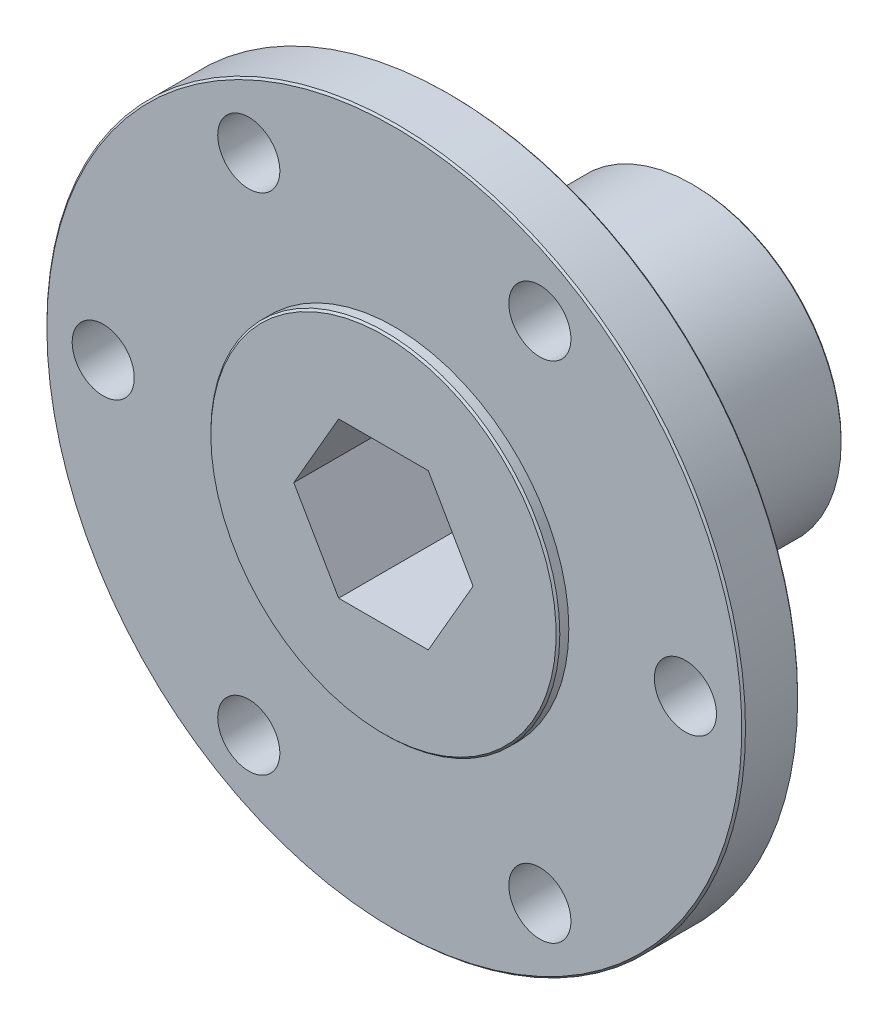
ISO-10303-21;
HEADER;
FILE_DESCRIPTION(('STEP AP214'),'2;1');
FILE_NAME('part.step','',(''),(''),'','','');
FILE_SCHEMA(('AUTOMOTIVE_DESIGN { 1 0 10303 214 1 1 1 1 }'));
ENDSEC;
DATA;
#1=APPLICATION_CONTEXT('core data for automotive mechanical design processes');
#2=APPLICATION_PROTOCOL_DEFINITION('international standard','automotive_design',2000,#1);
#3=PRODUCT_CONTEXT('',#1,'mechanical');
#4=PRODUCT('Part','Part','',(#3));
#5=PRODUCT_RELATED_PRODUCT_CATEGORY('part','',(#4));
#6=PRODUCT_DEFINITION_FORMATION('','',#4);
#7=PRODUCT_DEFINITION_CONTEXT('part definition',#1,'design');
#8=PRODUCT_DEFINITION('design','',#6,#7);
#9=PRODUCT_DEFINITION_SHAPE('','',#8);
#10=(LENGTH_UNIT() NAMED_UNIT(*) SI_UNIT(.MILLI.,.METRE.));
#11=(NAMED_UNIT(*) PLANE_ANGLE_UNIT() SI_UNIT($,.RADIAN.));
#12=(NAMED_UNIT(*) SI_UNIT($,.STERADIAN.) SOLID_ANGLE_UNIT());
#13=UNCERTAINTY_MEASURE_WITH_UNIT(LENGTH_MEASURE(1.E-05),#10,'distance_accuracy_value','');
#14=(GEOMETRIC_REPRESENTATION_CONTEXT(3) GLOBAL_UNCERTAINTY_ASSIGNED_CONTEXT((#13)) GLOBAL_UNIT_ASSIGNED_CONTEXT((#10,
#11,#12)) REPRESENTATION_CONTEXT('',''));
#15=CARTESIAN_POINT('',(0.,0.,0.));
#16=DIRECTION('',(0.,0.,1.));
#17=DIRECTION('',(1.,0.,0.));
#18=AXIS2_PLACEMENT_3D('',#15,#16,#17);
#19=CARTESIAN_POINT('',(-39.6748,0.,5.461));
#20=DIRECTION('',(0.,0.,1.));
#21=DIRECTION('',(1.,0.,0.));
#22=AXIS2_PLACEMENT_3D('',#19,#20,#21);
#23=PLANE('',#22);
#24=CARTESIAN_POINT('',(0.,0.,5.461));
#25=DIRECTION('',(0.,0.,1.));
#26=DIRECTION('',(-1.,0.,0.));
#27=AXIS2_PLACEMENT_3D('',#24,#25,#26);
#28=CIRCLE('',#27,28.4226);
#29=CARTESIAN_POINT('',(-28.4226,0.,5.461));
#30=VERTEX_POINT('',#29);
#31=EDGE_CURVE('E11',#30,#30,#28,.T.);
#32=ORIENTED_EDGE('',*,*,#31,.T.);
#33=EDGE_LOOP('',(#32));
#34=FACE_BOUND('',#33,.T.);
#35=CARTESIAN_POINT('',(-11.90625,20.6222299276169,5.461));
#36=DIRECTION('',(0.,0.,-1.));
#37=DIRECTION('',(-1.,0.,0.));
#38=AXIS2_PLACEMENT_3D('',#35,#36,#37);
#39=CIRCLE('',#38,2.53999999999993);
#40=CARTESIAN_POINT('',(-14.4462499999999,20.6222299276169,5.461));
#41=VERTEX_POINT('',#40);
#42=EDGE_CURVE('E53',#41,#41,#39,.T.);
#43=ORIENTED_EDGE('',*,*,#42,.T.);
#44=EDGE_LOOP('',(#43));
#45=FACE_BOUND('',#44,.T.);
#46=CARTESIAN_POINT('',(-23.8125,0.,5.461));
#47=DIRECTION('',(0.,0.,-1.));
#48=DIRECTION('',(-1.,0.,0.));
#49=AXIS2_PLACEMENT_3D('',#46,#47,#48);
#50=CIRCLE('',#49,2.54);
#51=CARTESIAN_POINT('',(-26.3525,0.,5.461));
#52=VERTEX_POINT('',#51);
#53=EDGE_CURVE('E299',#52,#52,#50,.T.);
#54=ORIENTED_EDGE('',*,*,#53,.T.);
#55=EDGE_LOOP('',(#54));
#56=FACE_BOUND('',#55,.T.);
#57=CARTESIAN_POINT('',(-11.90625,-20.6222299276169,5.461));
#58=DIRECTION('',(0.,0.,-1.));
#59=DIRECTION('',(-1.,0.,0.));
#60=AXIS2_PLACEMENT_3D('',#57,#58,#59);
#61=CIRCLE('',#60,2.53999999999996);
#62=CARTESIAN_POINT('',(-14.44625,-20.6222299276169,5.461));
#63=VERTEX_POINT('',#62);
#64=EDGE_CURVE('E303',#63,#63,#61,.T.);
#65=ORIENTED_EDGE('',*,*,#64,.T.);
#66=EDGE_LOOP('',(#65));
#67=FACE_BOUND('',#66,.T.);
#68=CARTESIAN_POINT('',(11.90625,-20.6222299276169,5.461));
#69=DIRECTION('',(0.,0.,-1.));
#70=DIRECTION('',(-1.,0.,0.));
#71=AXIS2_PLACEMENT_3D('',#68,#69,#70);
#72=CIRCLE('',#71,2.54);
#73=CARTESIAN_POINT('',(9.36625,-20.6222299276169,5.461));
#74=VERTEX_POINT('',#73);
#75=EDGE_CURVE('E317',#74,#74,#72,.T.);
#76=ORIENTED_EDGE('',*,*,#75,.T.);
#77=EDGE_LOOP('',(#76));
#78=FACE_BOUND('',#77,.T.);
#79=CARTESIAN_POINT('',(23.8125,0.,5.461));
#80=DIRECTION('',(0.,0.,-1.));
#81=DIRECTION('',(-1.,0.,0.));
#82=AXIS2_PLACEMENT_3D('',#79,#80,#81);
#83=CIRCLE('',#82,2.54);
#84=CARTESIAN_POINT('',(21.2725,0.,5.461));
#85=VERTEX_POINT('',#84);
#86=EDGE_CURVE('E268',#85,#85,#83,.T.);
#87=ORIENTED_EDGE('',*,*,#86,.T.);
#88=EDGE_LOOP('',(#87));
#89=FACE_BOUND('',#88,.T.);
#90=CARTESIAN_POINT('',(11.90625,20.6222299276169,5.461));
#91=DIRECTION('',(0.,0.,-1.));
#92=DIRECTION('',(-1.,0.,0.));
#93=AXIS2_PLACEMENT_3D('',#90,#91,#92);
#94=CIRCLE('',#93,2.54000000000004);
#95=CARTESIAN_POINT('',(9.36625,20.6222299276169,5.461));
#96=VERTEX_POINT('',#95);
#97=EDGE_CURVE('E264',#96,#96,#94,.T.);
#98=ORIENTED_EDGE('',*,*,#97,.T.);
#99=EDGE_LOOP('',(#98));
#100=FACE_BOUND('',#99,.T.);
#101=CARTESIAN_POINT('',(0.,0.,5.461));
#102=DIRECTION('',(0.,0.,-1.));
#103=DIRECTION('',(1.,0.,0.));
#104=AXIS2_PLACEMENT_3D('',#101,#102,#103);
#105=CIRCLE('',#104,14.2748);
#106=CARTESIAN_POINT('',(14.2748,0.,5.461));
#107=VERTEX_POINT('',#106);
#108=EDGE_CURVE('E269',#107,#107,#105,.T.);
#109=ORIENTED_EDGE('',*,*,#108,.T.);
#110=EDGE_LOOP('',(#109));
#111=FACE_BOUND('',#110,.T.);
#112=ADVANCED_FACE('F43',(#34,#45,#56,#67,#78,#89,#100,#111),#23,.T.);
#113=CARTESIAN_POINT('',(-11.90625,20.6222299276169,6.35));
#114=DIRECTION('',(0.,0.,-1.));
#115=DIRECTION('',(-1.,0.,0.));
#116=AXIS2_PLACEMENT_3D('',#113,#114,#115);
#117=CYLINDRICAL_SURFACE('',#116,2.53999999999993);
#118=CARTESIAN_POINT('',(-11.90625,20.6222299276169,0.889));
#119=DIRECTION('',(0.,0.,1.));
#120=DIRECTION('',(-1.,0.,0.));
#121=AXIS2_PLACEMENT_3D('',#118,#119,#120);
#122=CIRCLE('',#121,2.53999999999993);
#123=CARTESIAN_POINT('',(-14.4462499999999,20.6222299276169,0.889));
#124=VERTEX_POINT('',#123);
#125=EDGE_CURVE('E284',#124,#124,#122,.T.);
#126=ORIENTED_EDGE('',*,*,#125,.F.);
#127=EDGE_LOOP('',(#126));
#128=FACE_BOUND('',#127,.T.);
#129=ORIENTED_EDGE('',*,*,#42,.F.);
#130=EDGE_LOOP('',(#129));
#131=FACE_BOUND('',#130,.T.);
#132=ADVANCED_FACE('F376',(#128,#131),#117,.F.);
#133=CARTESIAN_POINT('',(-23.8125,0.,6.35));
#134=DIRECTION('',(0.,0.,-1.));
#135=DIRECTION('',(-1.,0.,0.));
#136=AXIS2_PLACEMENT_3D('',#133,#134,#135);
#137=CYLINDRICAL_SURFACE('',#136,2.54);
#138=CARTESIAN_POINT('',(-23.8125,0.,0.889));
#139=DIRECTION('',(0.,0.,1.));
#140=DIRECTION('',(-1.,0.,0.));
#141=AXIS2_PLACEMENT_3D('',#138,#139,#140);
#142=CIRCLE('',#141,2.54);
#143=CARTESIAN_POINT('',(-26.3525,0.,0.889));
#144=VERTEX_POINT('',#143);
#145=EDGE_CURVE('E298',#144,#144,#142,.T.);
#146=ORIENTED_EDGE('',*,*,#145,.F.);
#147=EDGE_LOOP('',(#146));
#148=FACE_BOUND('',#147,.T.);
#149=ORIENTED_EDGE('',*,*,#53,.F.);
#150=EDGE_LOOP('',(#149));
#151=FACE_BOUND('',#150,.T.);
#152=ADVANCED_FACE('F363',(#148,#151),#137,.F.);
#153=CARTESIAN_POINT('',(-11.90625,-20.6222299276169,6.35));
#154=DIRECTION('',(0.,0.,-1.));
#155=DIRECTION('',(-1.,0.,0.));
#156=AXIS2_PLACEMENT_3D('',#153,#154,#155);
#157=CYLINDRICAL_SURFACE('',#156,2.53999999999996);
#158=CARTESIAN_POINT('',(-11.90625,-20.6222299276169,0.889));
#159=DIRECTION('',(0.,0.,1.));
#160=DIRECTION('',(-1.,0.,0.));
#161=AXIS2_PLACEMENT_3D('',#158,#159,#160);
#162=CIRCLE('',#161,2.53999999999996);
#163=CARTESIAN_POINT('',(-14.44625,-20.6222299276169,0.889));
#164=VERTEX_POINT('',#163);
#165=EDGE_CURVE('E313',#164,#164,#162,.T.);
#166=ORIENTED_EDGE('',*,*,#165,.F.);
#167=EDGE_LOOP('',(#166));
#168=FACE_BOUND('',#167,.T.);
#169=ORIENTED_EDGE('',*,*,#64,.F.);
#170=EDGE_LOOP('',(#169));
#171=FACE_BOUND('',#170,.T.);
#172=ADVANCED_FACE('F360',(#168,#171),#157,.F.);
#173=CARTESIAN_POINT('',(11.90625,-20.6222299276169,6.35));
#174=DIRECTION('',(0.,0.,-1.));
#175=DIRECTION('',(-1.,0.,0.));
#176=AXIS2_PLACEMENT_3D('',#173,#174,#175);
#177=CYLINDRICAL_SURFACE('',#176,2.54);
#178=CARTESIAN_POINT('',(11.90625,-20.6222299276169,0.889));
#179=DIRECTION('',(0.,0.,1.));
#180=DIRECTION('',(-1.,0.,0.));
#181=AXIS2_PLACEMENT_3D('',#178,#179,#180);
#182=CIRCLE('',#181,2.54);
#183=CARTESIAN_POINT('',(9.36625,-20.6222299276169,0.889));
#184=VERTEX_POINT('',#183);
#185=EDGE_CURVE('E274',#184,#184,#182,.T.);
#186=ORIENTED_EDGE('',*,*,#185,.F.);
#187=EDGE_LOOP('',(#186));
#188=FACE_BOUND('',#187,.T.);
#189=ORIENTED_EDGE('',*,*,#75,.F.);
#190=EDGE_LOOP('',(#189));
#191=FACE_BOUND('',#190,.T.);
#192=ADVANCED_FACE('F362',(#188,#191),#177,.F.);
#193=CARTESIAN_POINT('',(23.8125,0.,6.35));
#194=DIRECTION('',(0.,0.,-1.));
#195=DIRECTION('',(-1.,0.,0.));
#196=AXIS2_PLACEMENT_3D('',#193,#194,#195);
#197=CYLINDRICAL_SURFACE('',#196,2.54);
#198=CARTESIAN_POINT('',(23.8125,0.,0.889));
#199=DIRECTION('',(0.,0.,1.));
#200=DIRECTION('',(-1.,0.,0.));
#201=AXIS2_PLACEMENT_3D('',#198,#199,#200);
#202=CIRCLE('',#201,2.54);
#203=CARTESIAN_POINT('',(21.2725,0.,0.889));
#204=VERTEX_POINT('',#203);
#205=EDGE_CURVE('E270',#204,#204,#202,.T.);
#206=ORIENTED_EDGE('',*,*,#205,.F.);
#207=EDGE_LOOP('',(#206));
#208=FACE_BOUND('',#207,.T.);
#209=ORIENTED_EDGE('',*,*,#86,.F.);
#210=EDGE_LOOP('',(#209));
#211=FACE_BOUND('',#210,.T.);
#212=ADVANCED_FACE('F372',(#208,#211),#197,.F.);
#213=CARTESIAN_POINT('',(11.90625,20.6222299276169,6.35));
#214=DIRECTION('',(0.,0.,-1.));
#215=DIRECTION('',(-1.,0.,0.));
#216=AXIS2_PLACEMENT_3D('',#213,#214,#215);
#217=CYLINDRICAL_SURFACE('',#216,2.54000000000004);
#218=CARTESIAN_POINT('',(11.90625,20.6222299276169,0.889));
#219=DIRECTION('',(0.,0.,1.));
#220=DIRECTION('',(-1.,0.,0.));
#221=AXIS2_PLACEMENT_3D('',#218,#219,#220);
#222=CIRCLE('',#221,2.54000000000004);
#223=CARTESIAN_POINT('',(9.36625,20.6222299276169,0.889));
#224=VERTEX_POINT('',#223);
#225=EDGE_CURVE('E47',#224,#224,#222,.T.);
#226=ORIENTED_EDGE('',*,*,#225,.F.);
#227=EDGE_LOOP('',(#226));
#228=FACE_BOUND('',#227,.T.);
#229=ORIENTED_EDGE('',*,*,#97,.F.);
#230=EDGE_LOOP('',(#229));
#231=FACE_BOUND('',#230,.T.);
#232=ADVANCED_FACE('F407',(#228,#231),#217,.F.);
#233=CARTESIAN_POINT('',(0.,0.,0.));
#234=DIRECTION('',(0.,0.,1.));
#235=DIRECTION('',(1.,0.,0.));
#236=AXIS2_PLACEMENT_3D('',#233,#234,#235);
#237=CYLINDRICAL_SURFACE('',#236,14.2748);
#238=CARTESIAN_POINT('',(0.,0.,6.1976));
#239=DIRECTION('',(0.,0.,-1.));
#240=DIRECTION('',(1.,0.,0.));
#241=AXIS2_PLACEMENT_3D('',#238,#239,#240);
#242=CIRCLE('',#241,14.2748);
#243=CARTESIAN_POINT('',(14.2748,0.,6.1976));
#244=VERTEX_POINT('',#243);
#245=EDGE_CURVE('E293',#244,#244,#242,.T.);
#246=ORIENTED_EDGE('',*,*,#245,.T.);
#247=EDGE_LOOP('',(#246));
#248=FACE_BOUND('',#247,.T.);
#249=ORIENTED_EDGE('',*,*,#108,.F.);
#250=EDGE_LOOP('',(#249));
#251=FACE_BOUND('',#250,.T.);
#252=ADVANCED_FACE('F398',(#248,#251),#237,.T.);
#253=CARTESIAN_POINT('',(0.,0.,5.3086));
#254=DIRECTION('',(0.,0.,-1.));
#255=DIRECTION('',(-1.,0.,0.));
#256=AXIS2_PLACEMENT_3D('',#253,#254,#255);
#257=CONICAL_SURFACE('',#256,28.575,0.785398163397451);
#258=CARTESIAN_POINT('',(0.,0.,5.3086));
#259=DIRECTION('',(0.,0.,1.));
#260=DIRECTION('',(-1.,0.,0.));
#261=AXIS2_PLACEMENT_3D('',#258,#259,#260);
#262=CIRCLE('',#261,28.575);
#263=CARTESIAN_POINT('',(-28.575,0.,5.3086));
#264=VERTEX_POINT('',#263);
#265=EDGE_CURVE('E283',#264,#264,#262,.T.);
#266=ORIENTED_EDGE('',*,*,#265,.T.);
#267=EDGE_LOOP('',(#266));
#268=FACE_BOUND('',#267,.T.);
#269=ORIENTED_EDGE('',*,*,#31,.F.);
#270=EDGE_LOOP('',(#269));
#271=FACE_BOUND('',#270,.T.);
#272=ADVANCED_FACE('F395',(#268,#271),#257,.T.);
#273=CARTESIAN_POINT('',(-39.6748,0.,0.889));
#274=DIRECTION('',(0.,0.,-1.));
#275=DIRECTION('',(0.,-1.,0.));
#276=AXIS2_PLACEMENT_3D('',#273,#274,#275);
#277=PLANE('',#276);
#278=CARTESIAN_POINT('',(0.,0.,0.889));
#279=DIRECTION('',(0.,0.,-1.));
#280=DIRECTION('',(1.,0.,0.));
#281=AXIS2_PLACEMENT_3D('',#278,#279,#280);
#282=CIRCLE('',#281,28.4226);
#283=CARTESIAN_POINT('',(28.4226,0.,0.889));
#284=VERTEX_POINT('',#283);
#285=EDGE_CURVE('E279',#284,#284,#282,.T.);
#286=ORIENTED_EDGE('',*,*,#285,.T.);
#287=EDGE_LOOP('',(#286));
#288=FACE_BOUND('',#287,.T.);
#289=ORIENTED_EDGE('',*,*,#125,.T.);
#290=EDGE_LOOP('',(#289));
#291=FACE_BOUND('',#290,.T.);
#292=ORIENTED_EDGE('',*,*,#145,.T.);
#293=EDGE_LOOP('',(#292));
#294=FACE_BOUND('',#293,.T.);
#295=ORIENTED_EDGE('',*,*,#165,.T.);
#296=EDGE_LOOP('',(#295));
#297=FACE_BOUND('',#296,.T.);
#298=ORIENTED_EDGE('',*,*,#185,.T.);
#299=EDGE_LOOP('',(#298));
#300=FACE_BOUND('',#299,.T.);
#301=ORIENTED_EDGE('',*,*,#205,.T.);
#302=EDGE_LOOP('',(#301));
#303=FACE_BOUND('',#302,.T.);
#304=ORIENTED_EDGE('',*,*,#225,.T.);
#305=EDGE_LOOP('',(#304));
#306=FACE_BOUND('',#305,.T.);
#307=CARTESIAN_POINT('',(0.,0.,0.889));
#308=DIRECTION('',(0.,0.,1.));
#309=DIRECTION('',(1.,0.,0.));
#310=AXIS2_PLACEMENT_3D('',#307,#308,#309);
#311=CIRCLE('',#310,14.2748);
#312=CARTESIAN_POINT('',(14.2748,0.,0.889));
#313=VERTEX_POINT('',#312);
#314=EDGE_CURVE('E289',#313,#313,#311,.T.);
#315=ORIENTED_EDGE('',*,*,#314,.T.);
#316=EDGE_LOOP('',(#315));
#317=FACE_BOUND('',#316,.T.);
#318=ADVANCED_FACE('F397',(#288,#291,#294,#297,#300,#303,#306,#317),#277,.T.);
#319=CARTESIAN_POINT('',(0.,0.,6.1976));
#320=DIRECTION('',(0.,0.,-1.));
#321=DIRECTION('',(-1.,0.,0.));
#322=AXIS2_PLACEMENT_3D('',#319,#320,#321);
#323=CONICAL_SURFACE('',#322,14.2748,0.785398163397477);
#324=ORIENTED_EDGE('',*,*,#245,.F.);
#325=EDGE_LOOP('',(#324));
#326=FACE_BOUND('',#325,.T.);
#327=CARTESIAN_POINT('',(0.,0.,6.35));
#328=DIRECTION('',(0.,0.,-1.));
#329=DIRECTION('',(-1.,0.,0.));
#330=AXIS2_PLACEMENT_3D('',#327,#328,#329);
#331=CIRCLE('',#330,14.1224);
#332=CARTESIAN_POINT('',(-14.1224,0.,6.35));
#333=VERTEX_POINT('',#332);
#334=EDGE_CURVE('E285',#333,#333,#331,.T.);
#335=ORIENTED_EDGE('',*,*,#334,.T.);
#336=EDGE_LOOP('',(#335));
#337=FACE_BOUND('',#336,.T.);
#338=ADVANCED_FACE('F393',(#326,#337),#323,.T.);
#339=CARTESIAN_POINT('',(0.,0.,6.35));
#340=DIRECTION('',(0.,0.,-1.));
#341=DIRECTION('',(-1.,0.,0.));
#342=AXIS2_PLACEMENT_3D('',#339,#340,#341);
#343=CYLINDRICAL_SURFACE('',#342,28.575);
#344=ORIENTED_EDGE('',*,*,#265,.F.);
#345=EDGE_LOOP('',(#344));
#346=FACE_BOUND('',#345,.T.);
#347=CARTESIAN_POINT('',(0.,0.,1.04140000000001));
#348=DIRECTION('',(0.,0.,1.));
#349=DIRECTION('',(-1.,0.,0.));
#350=AXIS2_PLACEMENT_3D('',#347,#348,#349);
#351=CIRCLE('',#350,28.575);
#352=CARTESIAN_POINT('',(-28.575,0.,1.04140000000001));
#353=VERTEX_POINT('',#352);
#354=EDGE_CURVE('E290',#353,#353,#351,.T.);
#355=ORIENTED_EDGE('',*,*,#354,.T.);
#356=EDGE_LOOP('',(#355));
#357=FACE_BOUND('',#356,.T.);
#358=ADVANCED_FACE('F412',(#346,#357),#343,.T.);
#359=CARTESIAN_POINT('',(0.,0.,0.));
#360=DIRECTION('',(0.,0.,1.));
#361=DIRECTION('',(1.,0.,0.));
#362=AXIS2_PLACEMENT_3D('',#359,#360,#361);
#363=CYLINDRICAL_SURFACE('',#362,14.2748);
#364=ORIENTED_EDGE('',*,*,#314,.F.);
#365=EDGE_LOOP('',(#364));
#366=FACE_BOUND('',#365,.T.);
#367=CARTESIAN_POINT('',(0.,0.,0.1524));
#368=DIRECTION('',(0.,0.,1.));
#369=DIRECTION('',(1.,0.,0.));
#370=AXIS2_PLACEMENT_3D('',#367,#368,#369);
#371=CIRCLE('',#370,14.2748);
#372=CARTESIAN_POINT('',(14.2748,0.,0.1524));
#373=VERTEX_POINT('',#372);
#374=EDGE_CURVE('E308',#373,#373,#371,.T.);
#375=ORIENTED_EDGE('',*,*,#374,.T.);
#376=EDGE_LOOP('',(#375));
#377=FACE_BOUND('',#376,.T.);
#378=ADVANCED_FACE('F415',(#366,#377),#363,.T.);
#379=CARTESIAN_POINT('',(0.,0.,1.04140000000001));
#380=DIRECTION('',(0.,0.,1.));
#381=DIRECTION('',(1.,0.,0.));
#382=AXIS2_PLACEMENT_3D('',#379,#380,#381);
#383=CONICAL_SURFACE('',#382,28.575,0.785398163397446);
#384=ORIENTED_EDGE('',*,*,#354,.F.);
#385=EDGE_LOOP('',(#384));
#386=FACE_BOUND('',#385,.T.);
#387=ORIENTED_EDGE('',*,*,#285,.F.);
#388=EDGE_LOOP('',(#387));
#389=FACE_BOUND('',#388,.T.);
#390=ADVANCED_FACE('F418',(#386,#389),#383,.T.);
#391=CARTESIAN_POINT('',(0.,0.,6.35));
#392=DIRECTION('',(0.,0.,1.));
#393=DIRECTION('',(1.,0.,0.));
#394=AXIS2_PLACEMENT_3D('',#391,#392,#393);
#395=PLANE('',#394);
#396=DIRECTION('',(-1.,0.,0.));
#397=VECTOR('',#396,1.);
#398=CARTESIAN_POINT('',(0.,-6.35,6.35));
#399=LINE('',#398,#397);
#400=CARTESIAN_POINT('',(3.66617420935413,-6.35,6.35));
#401=VERTEX_POINT('',#400);
#402=CARTESIAN_POINT('',(-3.66617420935412,-6.35,6.35));
#403=VERTEX_POINT('',#402);
#404=EDGE_CURVE('E218',#401,#403,#399,.T.);
#405=ORIENTED_EDGE('',*,*,#404,.T.);
#406=DIRECTION('',(-0.5,0.866025403784439,0.));
#407=VECTOR('',#406,1.);
#408=CARTESIAN_POINT('',(-5.49926131403119,-3.175,6.35));
#409=LINE('',#408,#407);
#410=CARTESIAN_POINT('',(-7.33234841870825,0.,6.35));
#411=VERTEX_POINT('',#410);
#412=EDGE_CURVE('E204',#403,#411,#409,.T.);
#413=ORIENTED_EDGE('',*,*,#412,.T.);
#414=DIRECTION('',(0.5,0.866025403784439,0.));
#415=VECTOR('',#414,1.);
#416=CARTESIAN_POINT('',(-5.49926131403118,3.175,6.35));
#417=LINE('',#416,#415);
#418=CARTESIAN_POINT('',(-3.66617420935412,6.35,6.35));
#419=VERTEX_POINT('',#418);
#420=EDGE_CURVE('E250',#411,#419,#417,.T.);
#421=ORIENTED_EDGE('',*,*,#420,.T.);
#422=DIRECTION('',(1.,0.,0.));
#423=VECTOR('',#422,1.);
#424=CARTESIAN_POINT('',(0.,6.35,6.35));
#425=LINE('',#424,#423);
#426=CARTESIAN_POINT('',(3.66617420935412,6.35,6.35));
#427=VERTEX_POINT('',#426);
#428=EDGE_CURVE('E245',#419,#427,#425,.T.);
#429=ORIENTED_EDGE('',*,*,#428,.T.);
#430=DIRECTION('',(0.5,-0.866025403784439,0.));
#431=VECTOR('',#430,1.);
#432=CARTESIAN_POINT('',(5.49926131403119,3.175,6.35));
#433=LINE('',#432,#431);
#434=CARTESIAN_POINT('',(7.33234841870825,0.,6.35));
#435=VERTEX_POINT('',#434);
#436=EDGE_CURVE('E241',#427,#435,#433,.T.);
#437=ORIENTED_EDGE('',*,*,#436,.T.);
#438=DIRECTION('',(-0.5,-0.866025403784439,0.));
#439=VECTOR('',#438,1.);
#440=CARTESIAN_POINT('',(5.49926131403119,-3.175,6.35));
#441=LINE('',#440,#439);
#442=EDGE_CURVE('E228',#435,#401,#441,.T.);
#443=ORIENTED_EDGE('',*,*,#442,.T.);
#444=EDGE_LOOP('',(#405,#413,#421,#429,#437,#443));
#445=FACE_BOUND('',#444,.T.);
#446=ORIENTED_EDGE('',*,*,#334,.F.);
#447=EDGE_LOOP('',(#446));
#448=FACE_BOUND('',#447,.T.);
#449=ADVANCED_FACE('F225',(#445,#448),#395,.T.);
#450=CARTESIAN_POINT('',(0.,0.,0.1524));
#451=DIRECTION('',(0.,0.,1.));
#452=DIRECTION('',(1.,0.,0.));
#453=AXIS2_PLACEMENT_3D('',#450,#451,#452);
#454=CONICAL_SURFACE('',#453,14.2748,0.785398163397461);
#455=ORIENTED_EDGE('',*,*,#374,.F.);
#456=EDGE_LOOP('',(#455));
#457=FACE_BOUND('',#456,.T.);
#458=CARTESIAN_POINT('',(0.,0.,0.));
#459=DIRECTION('',(0.,0.,1.));
#460=DIRECTION('',(1.,0.,0.));
#461=AXIS2_PLACEMENT_3D('',#458,#459,#460);
#462=CIRCLE('',#461,14.1224);
#463=CARTESIAN_POINT('',(14.1224,0.,0.));
#464=VERTEX_POINT('',#463);
#465=EDGE_CURVE('E304',#464,#464,#462,.T.);
#466=ORIENTED_EDGE('',*,*,#465,.T.);
#467=EDGE_LOOP('',(#466));
#468=FACE_BOUND('',#467,.T.);
#469=ADVANCED_FACE('F434',(#457,#468),#454,.T.);
#470=CARTESIAN_POINT('',(0.,0.,0.));
#471=DIRECTION('',(0.,0.,1.));
#472=DIRECTION('',(1.,0.,0.));
#473=AXIS2_PLACEMENT_3D('',#470,#471,#472);
#474=PLANE('',#473);
#475=ORIENTED_EDGE('',*,*,#465,.F.);
#476=EDGE_LOOP('',(#475));
#477=FACE_BOUND('',#476,.T.);
#478=CARTESIAN_POINT('',(0.,0.,0.));
#479=DIRECTION('',(0.,0.,-1.));
#480=DIRECTION('',(1.,0.,0.));
#481=AXIS2_PLACEMENT_3D('',#478,#479,#480);
#482=CIRCLE('',#481,12.7);
#483=CARTESIAN_POINT('',(12.7,0.,0.));
#484=VERTEX_POINT('',#483);
#485=EDGE_CURVE('E336',#484,#484,#482,.T.);
#486=ORIENTED_EDGE('',*,*,#485,.F.);
#487=EDGE_LOOP('',(#486));
#488=FACE_BOUND('',#487,.T.);
#489=ADVANCED_FACE('F437',(#477,#488),#474,.F.);
#490=CARTESIAN_POINT('',(0.,0.,-19.05));
#491=DIRECTION('',(0.,0.,-1.));
#492=DIRECTION('',(0.,-1.,0.));
#493=AXIS2_PLACEMENT_3D('',#490,#491,#492);
#494=PLANE('',#493);
#495=DIRECTION('',(-1.,0.,0.));
#496=VECTOR('',#495,1.);
#497=CARTESIAN_POINT('',(0.,-6.35,-19.05));
#498=LINE('',#497,#496);
#499=CARTESIAN_POINT('',(3.66617420935412,-6.35,-19.05));
#500=VERTEX_POINT('',#499);
#501=CARTESIAN_POINT('',(-3.66617420935412,-6.35,-19.05));
#502=VERTEX_POINT('',#501);
#503=EDGE_CURVE('E221',#500,#502,#498,.T.);
#504=ORIENTED_EDGE('',*,*,#503,.F.);
#505=DIRECTION('',(-0.5,-0.866025403784439,0.));
#506=VECTOR('',#505,1.);
#507=CARTESIAN_POINT('',(5.49926131403119,-3.175,-19.05));
#508=LINE('',#507,#506);
#509=CARTESIAN_POINT('',(7.33234841870825,0.,-19.05));
#510=VERTEX_POINT('',#509);
#511=EDGE_CURVE('E236',#510,#500,#508,.T.);
#512=ORIENTED_EDGE('',*,*,#511,.F.);
#513=DIRECTION('',(0.5,-0.866025403784439,0.));
#514=VECTOR('',#513,1.);
#515=CARTESIAN_POINT('',(5.49926131403119,3.175,-19.05));
#516=LINE('',#515,#514);
#517=CARTESIAN_POINT('',(3.66617420935412,6.35,-19.05));
#518=VERTEX_POINT('',#517);
#519=EDGE_CURVE('E69',#518,#510,#516,.T.);
#520=ORIENTED_EDGE('',*,*,#519,.F.);
#521=DIRECTION('',(1.,0.,0.));
#522=VECTOR('',#521,1.);
#523=CARTESIAN_POINT('',(0.,6.35,-19.05));
#524=LINE('',#523,#522);
#525=CARTESIAN_POINT('',(-3.66617420935412,6.35,-19.05));
#526=VERTEX_POINT('',#525);
#527=EDGE_CURVE('E232',#526,#518,#524,.T.);
#528=ORIENTED_EDGE('',*,*,#527,.F.);
#529=DIRECTION('',(0.5,0.866025403784439,0.));
#530=VECTOR('',#529,1.);
#531=CARTESIAN_POINT('',(-5.49926131403118,3.175,-19.05));
#532=LINE('',#531,#530);
#533=CARTESIAN_POINT('',(-7.33234841870825,0.,-19.05));
#534=VERTEX_POINT('',#533);
#535=EDGE_CURVE('E474',#534,#526,#532,.T.);
#536=ORIENTED_EDGE('',*,*,#535,.F.);
#537=DIRECTION('',(-0.5,0.866025403784439,0.));
#538=VECTOR('',#537,1.);
#539=CARTESIAN_POINT('',(-5.49926131403119,-3.175,-19.05));
#540=LINE('',#539,#538);
#541=EDGE_CURVE('E470',#502,#534,#540,.T.);
#542=ORIENTED_EDGE('',*,*,#541,.F.);
#543=EDGE_LOOP('',(#504,#512,#520,#528,#536,#542));
#544=FACE_BOUND('',#543,.T.);
#545=CARTESIAN_POINT('',(0.,0.,-19.05));
#546=DIRECTION('',(0.,0.,-1.));
#547=DIRECTION('',(1.,0.,0.));
#548=AXIS2_PLACEMENT_3D('',#545,#546,#547);
#549=CIRCLE('',#548,12.0396);
#550=CARTESIAN_POINT('',(12.0396,0.,-19.05));
#551=VERTEX_POINT('',#550);
#552=EDGE_CURVE('E309',#551,#551,#549,.T.);
#553=ORIENTED_EDGE('',*,*,#552,.T.);
#554=EDGE_LOOP('',(#553));
#555=FACE_BOUND('',#554,.T.);
#556=ADVANCED_FACE('F442',(#544,#555),#494,.T.);
#557=CARTESIAN_POINT('',(0.,0.,0.));
#558=DIRECTION('',(0.,0.,1.));
#559=DIRECTION('',(1.,0.,0.));
#560=AXIS2_PLACEMENT_3D('',#557,#558,#559);
#561=CONICAL_SURFACE('',#560,12.7,0.785398163397448);
#562=ORIENTED_EDGE('',*,*,#485,.T.);
#563=EDGE_LOOP('',(#562));
#564=FACE_BOUND('',#563,.T.);
#565=CARTESIAN_POINT('',(0.,0.,-0.50800000000005));
#566=DIRECTION('',(0.,0.,1.));
#567=DIRECTION('',(1.,0.,0.));
#568=AXIS2_PLACEMENT_3D('',#565,#566,#567);
#569=CIRCLE('',#568,12.192);
#570=CARTESIAN_POINT('',(12.192,0.,-0.50800000000005));
#571=VERTEX_POINT('',#570);
#572=EDGE_CURVE('E278',#571,#571,#569,.T.);
#573=ORIENTED_EDGE('',*,*,#572,.T.);
#574=EDGE_LOOP('',(#573));
#575=FACE_BOUND('',#574,.T.);
#576=ADVANCED_FACE('F45',(#564,#575),#561,.T.);
#577=CARTESIAN_POINT('',(0.,0.,-18.8976));
#578=DIRECTION('',(0.,0.,1.));
#579=DIRECTION('',(1.,0.,0.));
#580=AXIS2_PLACEMENT_3D('',#577,#578,#579);
#581=CONICAL_SURFACE('',#580,12.192,0.785398163397448);
#582=CARTESIAN_POINT('',(0.,0.,-18.8976));
#583=DIRECTION('',(0.,0.,-1.));
#584=DIRECTION('',(1.,0.,0.));
#585=AXIS2_PLACEMENT_3D('',#582,#583,#584);
#586=CIRCLE('',#585,12.192);
#587=CARTESIAN_POINT('',(12.192,0.,-18.8976));
#588=VERTEX_POINT('',#587);
#589=EDGE_CURVE('E263',#588,#588,#586,.T.);
#590=ORIENTED_EDGE('',*,*,#589,.T.);
#591=EDGE_LOOP('',(#590));
#592=FACE_BOUND('',#591,.T.);
#593=ORIENTED_EDGE('',*,*,#552,.F.);
#594=EDGE_LOOP('',(#593));
#595=FACE_BOUND('',#594,.T.);
#596=ADVANCED_FACE('F447',(#592,#595),#581,.T.);
#597=CARTESIAN_POINT('',(0.,0.,-19.05));
#598=DIRECTION('',(0.,0.,1.));
#599=DIRECTION('',(1.,0.,0.));
#600=AXIS2_PLACEMENT_3D('',#597,#598,#599);
#601=CYLINDRICAL_SURFACE('',#600,12.192);
#602=ORIENTED_EDGE('',*,*,#589,.F.);
#603=EDGE_LOOP('',(#602));
#604=FACE_BOUND('',#603,.T.);
#605=ORIENTED_EDGE('',*,*,#572,.F.);
#606=EDGE_LOOP('',(#605));
#607=FACE_BOUND('',#606,.T.);
#608=ADVANCED_FACE('F449',(#604,#607),#601,.T.);
#609=CARTESIAN_POINT('',(0.,-6.35,25.7495704419797));
#610=DIRECTION('',(0.,-1.,0.));
#611=DIRECTION('',(0.,0.,-1.));
#612=AXIS2_PLACEMENT_3D('',#609,#610,#611);
#613=PLANE('',#612);
#614=DIRECTION('',(0.,0.,-1.));
#615=VECTOR('',#614,1.);
#616=CARTESIAN_POINT('',(3.66617420935412,-6.35,25.7495704419797));
#617=LINE('',#616,#615);
#618=EDGE_CURVE('E61',#401,#500,#617,.T.);
#619=ORIENTED_EDGE('',*,*,#618,.T.);
#620=ORIENTED_EDGE('',*,*,#503,.T.);
#621=DIRECTION('',(0.,0.,-1.));
#622=VECTOR('',#621,1.);
#623=CARTESIAN_POINT('',(-3.66617420935412,-6.35,25.7495704419797));
#624=LINE('',#623,#622);
#625=EDGE_CURVE('E208',#403,#502,#624,.T.);
#626=ORIENTED_EDGE('',*,*,#625,.F.);
#627=ORIENTED_EDGE('',*,*,#404,.F.);
#628=EDGE_LOOP('',(#619,#620,#626,#627));
#629=FACE_BOUND('',#628,.T.);
#630=ADVANCED_FACE('F217',(#629),#613,.F.);
#631=CARTESIAN_POINT('',(-5.49926131403119,-3.175,25.7495704419797));
#632=DIRECTION('',(-0.866025403784439,-0.5,0.));
#633=DIRECTION('',(0.5,-0.866025403784439,0.));
#634=AXIS2_PLACEMENT_3D('',#631,#632,#633);
#635=PLANE('',#634);
#636=ORIENTED_EDGE('',*,*,#625,.T.);
#637=ORIENTED_EDGE('',*,*,#541,.T.);
#638=DIRECTION('',(0.,0.,-1.));
#639=VECTOR('',#638,1.);
#640=CARTESIAN_POINT('',(-7.33234841870825,0.,25.7495704419797));
#641=LINE('',#640,#639);
#642=EDGE_CURVE('E210',#411,#534,#641,.T.);
#643=ORIENTED_EDGE('',*,*,#642,.F.);
#644=ORIENTED_EDGE('',*,*,#412,.F.);
#645=EDGE_LOOP('',(#636,#637,#643,#644));
#646=FACE_BOUND('',#645,.T.);
#647=ADVANCED_FACE('F206',(#646),#635,.F.);
#648=CARTESIAN_POINT('',(-5.49926131403118,3.175,25.7495704419797));
#649=DIRECTION('',(-0.866025403784439,0.5,0.));
#650=DIRECTION('',(-0.5,-0.866025403784439,0.));
#651=AXIS2_PLACEMENT_3D('',#648,#649,#650);
#652=PLANE('',#651);
#653=ORIENTED_EDGE('',*,*,#642,.T.);
#654=ORIENTED_EDGE('',*,*,#535,.T.);
#655=DIRECTION('',(0.,0.,-1.));
#656=VECTOR('',#655,1.);
#657=CARTESIAN_POINT('',(-3.66617420935412,6.35,25.7495704419797));
#658=LINE('',#657,#656);
#659=EDGE_CURVE('E249',#419,#526,#658,.T.);
#660=ORIENTED_EDGE('',*,*,#659,.F.);
#661=ORIENTED_EDGE('',*,*,#420,.F.);
#662=EDGE_LOOP('',(#653,#654,#660,#661));
#663=FACE_BOUND('',#662,.T.);
#664=ADVANCED_FACE('F488',(#663),#652,.F.);
#665=CARTESIAN_POINT('',(0.,6.35,25.7495704419797));
#666=DIRECTION('',(0.,1.,0.));
#667=DIRECTION('',(0.,0.,1.));
#668=AXIS2_PLACEMENT_3D('',#665,#666,#667);
#669=PLANE('',#668);
#670=ORIENTED_EDGE('',*,*,#659,.T.);
#671=ORIENTED_EDGE('',*,*,#527,.T.);
#672=DIRECTION('',(0.,0.,-1.));
#673=VECTOR('',#672,1.);
#674=CARTESIAN_POINT('',(3.66617420935412,6.35,25.7495704419797));
#675=LINE('',#674,#673);
#676=EDGE_CURVE('E244',#427,#518,#675,.T.);
#677=ORIENTED_EDGE('',*,*,#676,.F.);
#678=ORIENTED_EDGE('',*,*,#428,.F.);
#679=EDGE_LOOP('',(#670,#671,#677,#678));
#680=FACE_BOUND('',#679,.T.);
#681=ADVANCED_FACE('F485',(#680),#669,.F.);
#682=CARTESIAN_POINT('',(5.49926131403119,3.175,25.7495704419797));
#683=DIRECTION('',(0.866025403784438,0.5,0.));
#684=DIRECTION('',(-0.5,0.866025403784439,0.));
#685=AXIS2_PLACEMENT_3D('',#682,#683,#684);
#686=PLANE('',#685);
#687=ORIENTED_EDGE('',*,*,#676,.T.);
#688=ORIENTED_EDGE('',*,*,#519,.T.);
#689=DIRECTION('',(0.,0.,-1.));
#690=VECTOR('',#689,1.);
#691=CARTESIAN_POINT('',(7.33234841870825,0.,25.7495704419797));
#692=LINE('',#691,#690);
#693=EDGE_CURVE('E240',#435,#510,#692,.T.);
#694=ORIENTED_EDGE('',*,*,#693,.F.);
#695=ORIENTED_EDGE('',*,*,#436,.F.);
#696=EDGE_LOOP('',(#687,#688,#694,#695));
#697=FACE_BOUND('',#696,.T.);
#698=ADVANCED_FACE('F489',(#697),#686,.F.);
#699=CARTESIAN_POINT('',(5.49926131403119,-3.175,25.7495704419797));
#700=DIRECTION('',(0.866025403784438,-0.5,0.));
#701=DIRECTION('',(0.5,0.866025403784439,0.));
#702=AXIS2_PLACEMENT_3D('',#699,#700,#701);
#703=PLANE('',#702);
#704=ORIENTED_EDGE('',*,*,#693,.T.);
#705=ORIENTED_EDGE('',*,*,#511,.T.);
#706=ORIENTED_EDGE('',*,*,#618,.F.);
#707=ORIENTED_EDGE('',*,*,#442,.F.);
#708=EDGE_LOOP('',(#704,#705,#706,#707));
#709=FACE_BOUND('',#708,.T.);
#710=ADVANCED_FACE('F490',(#709),#703,.F.);
#711=CLOSED_SHELL('',(#112,#132,#152,#172,#192,#212,#232,#252,#272,#318,#338,#358,#378,#390,
#449,#469,#489,#556,#576,#596,#608,#630,#647,#664,#681,#698,#710));
#712=MANIFOLD_SOLID_BREP('B2',#711);
#713=ADVANCED_BREP_SHAPE_REPRESENTATION('',(#18,#712),#14);
#714=SHAPE_DEFINITION_REPRESENTATION(#9,#713);
ENDSEC;
END-ISO-10303-21;
